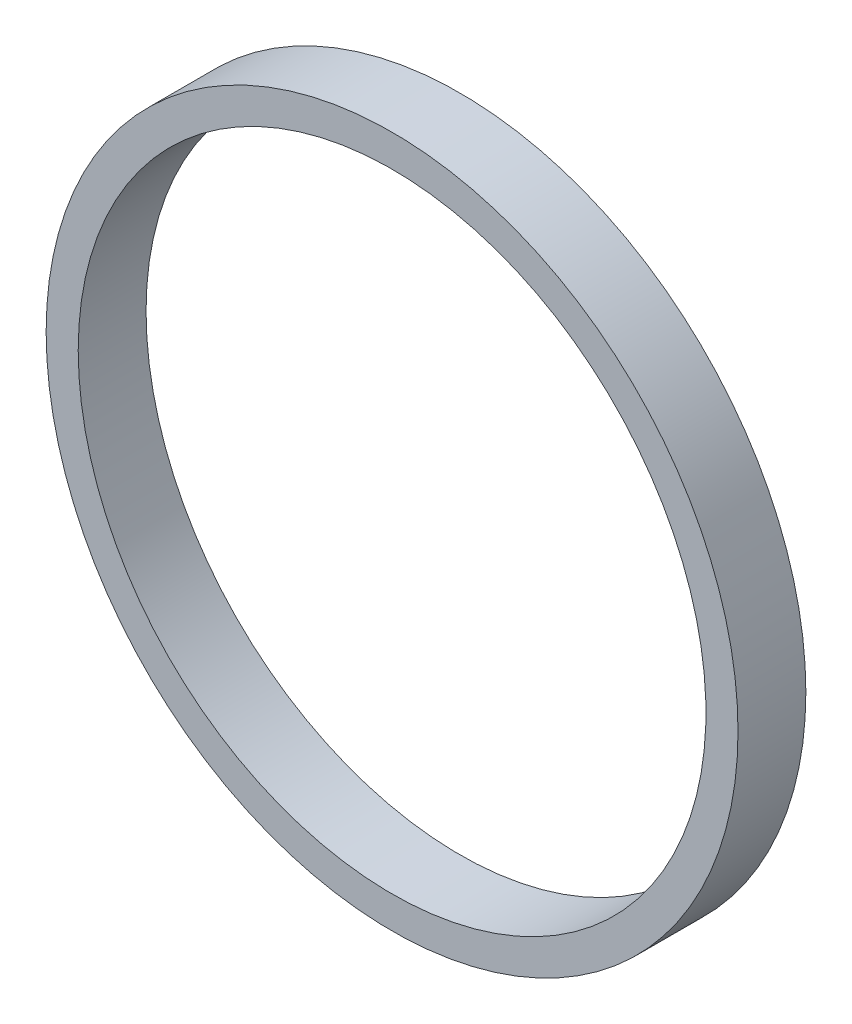
ISO-10303-21;
HEADER;
FILE_DESCRIPTION(('STEP AP214'),'2;1');
FILE_NAME('part.step','',(''),(''),'','','');
FILE_SCHEMA(('AUTOMOTIVE_DESIGN { 1 0 10303 214 1 1 1 1 }'));
ENDSEC;
DATA;
#1=APPLICATION_CONTEXT('core data for automotive mechanical design processes');
#2=APPLICATION_PROTOCOL_DEFINITION('international standard','automotive_design',2000,#1);
#3=PRODUCT_CONTEXT('',#1,'mechanical');
#4=PRODUCT('Part','Part','',(#3));
#5=PRODUCT_RELATED_PRODUCT_CATEGORY('part','',(#4));
#6=PRODUCT_DEFINITION_FORMATION('','',#4);
#7=PRODUCT_DEFINITION_CONTEXT('part definition',#1,'design');
#8=PRODUCT_DEFINITION('design','',#6,#7);
#9=PRODUCT_DEFINITION_SHAPE('','',#8);
#10=(LENGTH_UNIT() NAMED_UNIT(*) SI_UNIT(.MILLI.,.METRE.));
#11=(NAMED_UNIT(*) PLANE_ANGLE_UNIT() SI_UNIT($,.RADIAN.));
#12=(NAMED_UNIT(*) SI_UNIT($,.STERADIAN.) SOLID_ANGLE_UNIT());
#13=UNCERTAINTY_MEASURE_WITH_UNIT(LENGTH_MEASURE(1.E-05),#10,'distance_accuracy_value','');
#14=(GEOMETRIC_REPRESENTATION_CONTEXT(3) GLOBAL_UNCERTAINTY_ASSIGNED_CONTEXT((#13)) GLOBAL_UNIT_ASSIGNED_CONTEXT((#10,
#11,#12)) REPRESENTATION_CONTEXT('',''));
#15=CARTESIAN_POINT('',(0.,0.,0.));
#16=DIRECTION('',(0.,0.,1.));
#17=DIRECTION('',(1.,0.,0.));
#18=AXIS2_PLACEMENT_3D('',#15,#16,#17);
#19=CARTESIAN_POINT('',(16.,16.,9.68));
#20=DIRECTION('',(0.,0.,-1.));
#21=DIRECTION('',(-1.,0.,0.));
#22=AXIS2_PLACEMENT_3D('',#19,#20,#21);
#23=CYLINDRICAL_SURFACE('',#22,5.8751784);
#24=CARTESIAN_POINT('',(16.,16.,10.95));
#25=DIRECTION('',(0.,0.,-1.));
#26=DIRECTION('',(-1.,0.,0.));
#27=AXIS2_PLACEMENT_3D('',#24,#25,#26);
#28=CIRCLE('',#27,5.8751784);
#29=CARTESIAN_POINT('',(10.1248216,16.,10.95));
#30=VERTEX_POINT('',#29);
#31=EDGE_CURVE('E27',#30,#30,#28,.T.);
#32=ORIENTED_EDGE('',*,*,#31,.F.);
#33=EDGE_LOOP('',(#32));
#34=FACE_BOUND('',#33,.T.);
#35=CARTESIAN_POINT('',(16.,16.,9.68));
#36=DIRECTION('',(0.,0.,-1.));
#37=DIRECTION('',(-1.,0.,0.));
#38=AXIS2_PLACEMENT_3D('',#35,#36,#37);
#39=CIRCLE('',#38,5.8751784);
#40=CARTESIAN_POINT('',(10.1248216,16.,9.68));
#41=VERTEX_POINT('',#40);
#42=EDGE_CURVE('E18',#41,#41,#39,.T.);
#43=ORIENTED_EDGE('',*,*,#42,.T.);
#44=EDGE_LOOP('',(#43));
#45=FACE_BOUND('',#44,.T.);
#46=ADVANCED_FACE('F15',(#34,#45),#23,.F.);
#47=CARTESIAN_POINT('',(28.00000000001,16.000000000005,9.68));
#48=DIRECTION('',(0.,0.,1.));
#49=DIRECTION('',(1.,0.,0.));
#50=AXIS2_PLACEMENT_3D('',#47,#48,#49);
#51=PLANE('',#50);
#52=CARTESIAN_POINT('',(16.,16.,9.68));
#53=DIRECTION('',(0.,0.,-1.));
#54=DIRECTION('',(-1.,0.,0.));
#55=AXIS2_PLACEMENT_3D('',#52,#53,#54);
#56=CIRCLE('',#55,6.4754378);
#57=CARTESIAN_POINT('',(9.5245622,16.,9.68));
#58=VERTEX_POINT('',#57);
#59=EDGE_CURVE('E22',#58,#58,#56,.F.);
#60=ORIENTED_EDGE('',*,*,#59,.F.);
#61=EDGE_LOOP('',(#60));
#62=FACE_BOUND('',#61,.T.);
#63=ORIENTED_EDGE('',*,*,#42,.F.);
#64=EDGE_LOOP('',(#63));
#65=FACE_BOUND('',#64,.T.);
#66=ADVANCED_FACE('F36',(#62,#65),#51,.F.);
#67=CARTESIAN_POINT('',(28.00000000001,16.000000000005,10.95));
#68=DIRECTION('',(0.,0.,1.));
#69=DIRECTION('',(1.,0.,0.));
#70=AXIS2_PLACEMENT_3D('',#67,#68,#69);
#71=PLANE('',#70);
#72=CARTESIAN_POINT('',(16.,16.,10.95));
#73=DIRECTION('',(0.,0.,-1.));
#74=DIRECTION('',(-1.,0.,0.));
#75=AXIS2_PLACEMENT_3D('',#72,#73,#74);
#76=CIRCLE('',#75,6.4754378);
#77=CARTESIAN_POINT('',(9.5245622,16.,10.95));
#78=VERTEX_POINT('',#77);
#79=EDGE_CURVE('E10',#78,#78,#76,.T.);
#80=ORIENTED_EDGE('',*,*,#79,.F.);
#81=EDGE_LOOP('',(#80));
#82=FACE_BOUND('',#81,.T.);
#83=ORIENTED_EDGE('',*,*,#31,.T.);
#84=EDGE_LOOP('',(#83));
#85=FACE_BOUND('',#84,.T.);
#86=ADVANCED_FACE('F38',(#82,#85),#71,.T.);
#87=CARTESIAN_POINT('',(16.,16.,9.68));
#88=DIRECTION('',(0.,0.,-1.));
#89=DIRECTION('',(-1.,0.,0.));
#90=AXIS2_PLACEMENT_3D('',#87,#88,#89);
#91=CYLINDRICAL_SURFACE('',#90,6.4754378);
#92=ORIENTED_EDGE('',*,*,#79,.T.);
#93=EDGE_LOOP('',(#92));
#94=FACE_BOUND('',#93,.T.);
#95=ORIENTED_EDGE('',*,*,#59,.T.);
#96=EDGE_LOOP('',(#95));
#97=FACE_BOUND('',#96,.T.);
#98=ADVANCED_FACE('F45',(#94,#97),#91,.T.);
#99=CLOSED_SHELL('',(#46,#66,#86,#98));
#100=MANIFOLD_SOLID_BREP('B1',#99);
#101=ADVANCED_BREP_SHAPE_REPRESENTATION('',(#18,#100),#14);
#102=SHAPE_DEFINITION_REPRESENTATION(#9,#101);
ENDSEC;
END-ISO-10303-21;
